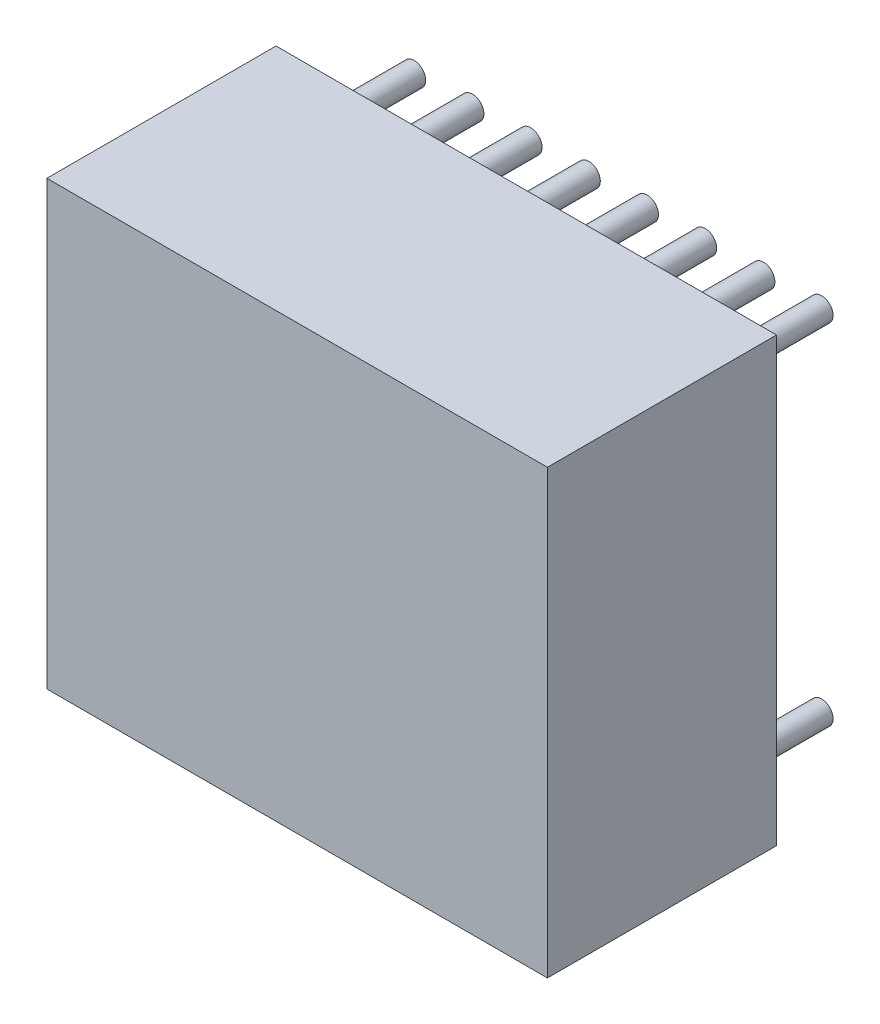
ISO-10303-21;
HEADER;
FILE_DESCRIPTION(('STEP AP214'),'2;1');
FILE_NAME('part.step','',(''),(''),'','','');
FILE_SCHEMA(('AUTOMOTIVE_DESIGN { 1 0 10303 214 1 1 1 1 }'));
ENDSEC;
DATA;
#1=APPLICATION_CONTEXT('core data for automotive mechanical design processes');
#2=APPLICATION_PROTOCOL_DEFINITION('international standard','automotive_design',2000,#1);
#3=PRODUCT_CONTEXT('',#1,'mechanical');
#4=PRODUCT('Part','Part','',(#3));
#5=PRODUCT_RELATED_PRODUCT_CATEGORY('part','',(#4));
#6=PRODUCT_DEFINITION_FORMATION('','',#4);
#7=PRODUCT_DEFINITION_CONTEXT('part definition',#1,'design');
#8=PRODUCT_DEFINITION('design','',#6,#7);
#9=PRODUCT_DEFINITION_SHAPE('','',#8);
#10=(LENGTH_UNIT() NAMED_UNIT(*) SI_UNIT(.MILLI.,.METRE.));
#11=(NAMED_UNIT(*) PLANE_ANGLE_UNIT() SI_UNIT($,.RADIAN.));
#12=(NAMED_UNIT(*) SI_UNIT($,.STERADIAN.) SOLID_ANGLE_UNIT());
#13=UNCERTAINTY_MEASURE_WITH_UNIT(LENGTH_MEASURE(1.E-05),#10,'distance_accuracy_value','');
#14=(GEOMETRIC_REPRESENTATION_CONTEXT(3) GLOBAL_UNCERTAINTY_ASSIGNED_CONTEXT((#13)) GLOBAL_UNIT_ASSIGNED_CONTEXT((#10,
#11,#12)) REPRESENTATION_CONTEXT('',''));
#15=CARTESIAN_POINT('',(0.,0.,0.));
#16=DIRECTION('',(0.,0.,1.));
#17=DIRECTION('',(1.,0.,0.));
#18=AXIS2_PLACEMENT_3D('',#15,#16,#17);
#19=CARTESIAN_POINT('',(0.,7.62,-2.));
#20=DIRECTION('',(0.,0.,1.));
#21=DIRECTION('',(1.,0.,0.));
#22=AXIS2_PLACEMENT_3D('',#19,#20,#21);
#23=CYLINDRICAL_SURFACE('',#22,0.25);
#24=CARTESIAN_POINT('',(0.,7.62,-2.));
#25=DIRECTION('',(0.,0.,1.));
#26=DIRECTION('',(1.,0.,0.));
#27=AXIS2_PLACEMENT_3D('',#24,#25,#26);
#28=CIRCLE('',#27,0.25);
#29=CARTESIAN_POINT('',(0.25,7.62,-2.));
#30=VERTEX_POINT('',#29);
#31=EDGE_CURVE('E11',#30,#30,#28,.T.);
#32=ORIENTED_EDGE('',*,*,#31,.T.);
#33=EDGE_LOOP('',(#32));
#34=FACE_BOUND('',#33,.T.);
#35=CARTESIAN_POINT('',(0.,7.62,0.));
#36=DIRECTION('',(0.,0.,1.));
#37=DIRECTION('',(1.,0.,0.));
#38=AXIS2_PLACEMENT_3D('',#35,#36,#37);
#39=CIRCLE('',#38,0.25);
#40=CARTESIAN_POINT('',(0.25,7.62,0.));
#41=VERTEX_POINT('',#40);
#42=EDGE_CURVE('E43',#41,#41,#39,.T.);
#43=ORIENTED_EDGE('',*,*,#42,.F.);
#44=EDGE_LOOP('',(#43));
#45=FACE_BOUND('',#44,.T.);
#46=ADVANCED_FACE('F40',(#34,#45),#23,.T.);
#47=CARTESIAN_POINT('',(0.,7.62,-2.));
#48=DIRECTION('',(0.,0.,1.));
#49=DIRECTION('',(1.,0.,0.));
#50=AXIS2_PLACEMENT_3D('',#47,#48,#49);
#51=PLANE('',#50);
#52=ORIENTED_EDGE('',*,*,#31,.F.);
#53=EDGE_LOOP('',(#52));
#54=FACE_BOUND('',#53,.T.);
#55=ADVANCED_FACE('F55',(#54),#51,.F.);
#56=CARTESIAN_POINT('',(0.,7.62,0.));
#57=DIRECTION('',(0.,0.,1.));
#58=DIRECTION('',(1.,0.,0.));
#59=AXIS2_PLACEMENT_3D('',#56,#57,#58);
#60=PLANE('',#59);
#61=ORIENTED_EDGE('',*,*,#42,.T.);
#62=EDGE_LOOP('',(#61));
#63=FACE_BOUND('',#62,.T.);
#64=ADVANCED_FACE('F52',(#63),#60,.T.);
#65=CLOSED_SHELL('',(#46,#55,#64));
#66=MANIFOLD_SOLID_BREP('B2',#65);
#67=CARTESIAN_POINT('',(1.27,7.62,-2.));
#68=DIRECTION('',(0.,0.,1.));
#69=DIRECTION('',(1.,0.,0.));
#70=AXIS2_PLACEMENT_3D('',#67,#68,#69);
#71=CYLINDRICAL_SURFACE('',#70,0.25);
#72=CARTESIAN_POINT('',(1.27,7.62,-2.));
#73=DIRECTION('',(0.,0.,1.));
#74=DIRECTION('',(1.,0.,0.));
#75=AXIS2_PLACEMENT_3D('',#72,#73,#74);
#76=CIRCLE('',#75,0.25);
#77=CARTESIAN_POINT('',(1.52,7.62,-2.));
#78=VERTEX_POINT('',#77);
#79=EDGE_CURVE('E39',#78,#78,#76,.T.);
#80=ORIENTED_EDGE('',*,*,#79,.T.);
#81=EDGE_LOOP('',(#80));
#82=FACE_BOUND('',#81,.T.);
#83=CARTESIAN_POINT('',(1.27,7.62,0.));
#84=DIRECTION('',(0.,0.,1.));
#85=DIRECTION('',(1.,0.,0.));
#86=AXIS2_PLACEMENT_3D('',#83,#84,#85);
#87=CIRCLE('',#86,0.25);
#88=CARTESIAN_POINT('',(1.52,7.62,0.));
#89=VERTEX_POINT('',#88);
#90=EDGE_CURVE('E92',#89,#89,#87,.T.);
#91=ORIENTED_EDGE('',*,*,#90,.F.);
#92=EDGE_LOOP('',(#91));
#93=FACE_BOUND('',#92,.T.);
#94=ADVANCED_FACE('F89',(#82,#93),#71,.T.);
#95=CARTESIAN_POINT('',(1.27,7.62,-2.));
#96=DIRECTION('',(0.,0.,1.));
#97=DIRECTION('',(1.,0.,0.));
#98=AXIS2_PLACEMENT_3D('',#95,#96,#97);
#99=PLANE('',#98);
#100=ORIENTED_EDGE('',*,*,#79,.F.);
#101=EDGE_LOOP('',(#100));
#102=FACE_BOUND('',#101,.T.);
#103=ADVANCED_FACE('F104',(#102),#99,.F.);
#104=CARTESIAN_POINT('',(1.27,7.62,0.));
#105=DIRECTION('',(0.,0.,1.));
#106=DIRECTION('',(1.,0.,0.));
#107=AXIS2_PLACEMENT_3D('',#104,#105,#106);
#108=PLANE('',#107);
#109=ORIENTED_EDGE('',*,*,#90,.T.);
#110=EDGE_LOOP('',(#109));
#111=FACE_BOUND('',#110,.T.);
#112=ADVANCED_FACE('F101',(#111),#108,.T.);
#113=CLOSED_SHELL('',(#94,#103,#112));
#114=MANIFOLD_SOLID_BREP('B6',#113);
#115=CARTESIAN_POINT('',(2.54,7.62,-2.));
#116=DIRECTION('',(0.,0.,1.));
#117=DIRECTION('',(1.,0.,0.));
#118=AXIS2_PLACEMENT_3D('',#115,#116,#117);
#119=CYLINDRICAL_SURFACE('',#118,0.25);
#120=CARTESIAN_POINT('',(2.54,7.62,-2.));
#121=DIRECTION('',(0.,0.,1.));
#122=DIRECTION('',(1.,0.,0.));
#123=AXIS2_PLACEMENT_3D('',#120,#121,#122);
#124=CIRCLE('',#123,0.25);
#125=CARTESIAN_POINT('',(2.79,7.62,-2.));
#126=VERTEX_POINT('',#125);
#127=EDGE_CURVE('E88',#126,#126,#124,.T.);
#128=ORIENTED_EDGE('',*,*,#127,.T.);
#129=EDGE_LOOP('',(#128));
#130=FACE_BOUND('',#129,.T.);
#131=CARTESIAN_POINT('',(2.54,7.62,0.));
#132=DIRECTION('',(0.,0.,1.));
#133=DIRECTION('',(1.,0.,0.));
#134=AXIS2_PLACEMENT_3D('',#131,#132,#133);
#135=CIRCLE('',#134,0.25);
#136=CARTESIAN_POINT('',(2.79,7.62,0.));
#137=VERTEX_POINT('',#136);
#138=EDGE_CURVE('E141',#137,#137,#135,.T.);
#139=ORIENTED_EDGE('',*,*,#138,.F.);
#140=EDGE_LOOP('',(#139));
#141=FACE_BOUND('',#140,.T.);
#142=ADVANCED_FACE('F138',(#130,#141),#119,.T.);
#143=CARTESIAN_POINT('',(2.54,7.62,-2.));
#144=DIRECTION('',(0.,0.,1.));
#145=DIRECTION('',(1.,0.,0.));
#146=AXIS2_PLACEMENT_3D('',#143,#144,#145);
#147=PLANE('',#146);
#148=ORIENTED_EDGE('',*,*,#127,.F.);
#149=EDGE_LOOP('',(#148));
#150=FACE_BOUND('',#149,.T.);
#151=ADVANCED_FACE('F153',(#150),#147,.F.);
#152=CARTESIAN_POINT('',(2.54,7.62,0.));
#153=DIRECTION('',(0.,0.,1.));
#154=DIRECTION('',(1.,0.,0.));
#155=AXIS2_PLACEMENT_3D('',#152,#153,#154);
#156=PLANE('',#155);
#157=ORIENTED_EDGE('',*,*,#138,.T.);
#158=EDGE_LOOP('',(#157));
#159=FACE_BOUND('',#158,.T.);
#160=ADVANCED_FACE('F150',(#159),#156,.T.);
#161=CLOSED_SHELL('',(#142,#151,#160));
#162=MANIFOLD_SOLID_BREP('B34',#161);
#163=CARTESIAN_POINT('',(3.81,7.62,-2.));
#164=DIRECTION('',(0.,0.,1.));
#165=DIRECTION('',(1.,0.,0.));
#166=AXIS2_PLACEMENT_3D('',#163,#164,#165);
#167=CYLINDRICAL_SURFACE('',#166,0.25);
#168=CARTESIAN_POINT('',(3.81,7.62,-2.));
#169=DIRECTION('',(0.,0.,1.));
#170=DIRECTION('',(1.,0.,0.));
#171=AXIS2_PLACEMENT_3D('',#168,#169,#170);
#172=CIRCLE('',#171,0.25);
#173=CARTESIAN_POINT('',(4.06,7.62,-2.));
#174=VERTEX_POINT('',#173);
#175=EDGE_CURVE('E137',#174,#174,#172,.T.);
#176=ORIENTED_EDGE('',*,*,#175,.T.);
#177=EDGE_LOOP('',(#176));
#178=FACE_BOUND('',#177,.T.);
#179=CARTESIAN_POINT('',(3.81,7.62,0.));
#180=DIRECTION('',(0.,0.,1.));
#181=DIRECTION('',(1.,0.,0.));
#182=AXIS2_PLACEMENT_3D('',#179,#180,#181);
#183=CIRCLE('',#182,0.25);
#184=CARTESIAN_POINT('',(4.06,7.62,0.));
#185=VERTEX_POINT('',#184);
#186=EDGE_CURVE('E190',#185,#185,#183,.T.);
#187=ORIENTED_EDGE('',*,*,#186,.F.);
#188=EDGE_LOOP('',(#187));
#189=FACE_BOUND('',#188,.T.);
#190=ADVANCED_FACE('F187',(#178,#189),#167,.T.);
#191=CARTESIAN_POINT('',(3.81,7.62,-2.));
#192=DIRECTION('',(0.,0.,1.));
#193=DIRECTION('',(1.,0.,0.));
#194=AXIS2_PLACEMENT_3D('',#191,#192,#193);
#195=PLANE('',#194);
#196=ORIENTED_EDGE('',*,*,#175,.F.);
#197=EDGE_LOOP('',(#196));
#198=FACE_BOUND('',#197,.T.);
#199=ADVANCED_FACE('F202',(#198),#195,.F.);
#200=CARTESIAN_POINT('',(3.81,7.62,0.));
#201=DIRECTION('',(0.,0.,1.));
#202=DIRECTION('',(1.,0.,0.));
#203=AXIS2_PLACEMENT_3D('',#200,#201,#202);
#204=PLANE('',#203);
#205=ORIENTED_EDGE('',*,*,#186,.T.);
#206=EDGE_LOOP('',(#205));
#207=FACE_BOUND('',#206,.T.);
#208=ADVANCED_FACE('F199',(#207),#204,.T.);
#209=CLOSED_SHELL('',(#190,#199,#208));
#210=MANIFOLD_SOLID_BREP('B83',#209);
#211=CARTESIAN_POINT('',(5.08,7.62,-2.));
#212=DIRECTION('',(0.,0.,1.));
#213=DIRECTION('',(1.,0.,0.));
#214=AXIS2_PLACEMENT_3D('',#211,#212,#213);
#215=CYLINDRICAL_SURFACE('',#214,0.25);
#216=CARTESIAN_POINT('',(5.08,7.62,-2.));
#217=DIRECTION('',(0.,0.,1.));
#218=DIRECTION('',(1.,0.,0.));
#219=AXIS2_PLACEMENT_3D('',#216,#217,#218);
#220=CIRCLE('',#219,0.25);
#221=CARTESIAN_POINT('',(5.33,7.62,-2.));
#222=VERTEX_POINT('',#221);
#223=EDGE_CURVE('E186',#222,#222,#220,.T.);
#224=ORIENTED_EDGE('',*,*,#223,.T.);
#225=EDGE_LOOP('',(#224));
#226=FACE_BOUND('',#225,.T.);
#227=CARTESIAN_POINT('',(5.08,7.62,0.));
#228=DIRECTION('',(0.,0.,1.));
#229=DIRECTION('',(1.,0.,0.));
#230=AXIS2_PLACEMENT_3D('',#227,#228,#229);
#231=CIRCLE('',#230,0.25);
#232=CARTESIAN_POINT('',(5.33,7.62,0.));
#233=VERTEX_POINT('',#232);
#234=EDGE_CURVE('E239',#233,#233,#231,.T.);
#235=ORIENTED_EDGE('',*,*,#234,.F.);
#236=EDGE_LOOP('',(#235));
#237=FACE_BOUND('',#236,.T.);
#238=ADVANCED_FACE('F236',(#226,#237),#215,.T.);
#239=CARTESIAN_POINT('',(5.08,7.62,-2.));
#240=DIRECTION('',(0.,0.,1.));
#241=DIRECTION('',(1.,0.,0.));
#242=AXIS2_PLACEMENT_3D('',#239,#240,#241);
#243=PLANE('',#242);
#244=ORIENTED_EDGE('',*,*,#223,.F.);
#245=EDGE_LOOP('',(#244));
#246=FACE_BOUND('',#245,.T.);
#247=ADVANCED_FACE('F251',(#246),#243,.F.);
#248=CARTESIAN_POINT('',(5.08,7.62,0.));
#249=DIRECTION('',(0.,0.,1.));
#250=DIRECTION('',(1.,0.,0.));
#251=AXIS2_PLACEMENT_3D('',#248,#249,#250);
#252=PLANE('',#251);
#253=ORIENTED_EDGE('',*,*,#234,.T.);
#254=EDGE_LOOP('',(#253));
#255=FACE_BOUND('',#254,.T.);
#256=ADVANCED_FACE('F248',(#255),#252,.T.);
#257=CLOSED_SHELL('',(#238,#247,#256));
#258=MANIFOLD_SOLID_BREP('B132',#257);
#259=CARTESIAN_POINT('',(6.35,7.62,-2.));
#260=DIRECTION('',(0.,0.,1.));
#261=DIRECTION('',(1.,0.,0.));
#262=AXIS2_PLACEMENT_3D('',#259,#260,#261);
#263=CYLINDRICAL_SURFACE('',#262,0.25);
#264=CARTESIAN_POINT('',(6.35,7.62,-2.));
#265=DIRECTION('',(0.,0.,1.));
#266=DIRECTION('',(1.,0.,0.));
#267=AXIS2_PLACEMENT_3D('',#264,#265,#266);
#268=CIRCLE('',#267,0.25);
#269=CARTESIAN_POINT('',(6.6,7.62,-2.));
#270=VERTEX_POINT('',#269);
#271=EDGE_CURVE('E235',#270,#270,#268,.T.);
#272=ORIENTED_EDGE('',*,*,#271,.T.);
#273=EDGE_LOOP('',(#272));
#274=FACE_BOUND('',#273,.T.);
#275=CARTESIAN_POINT('',(6.35,7.62,0.));
#276=DIRECTION('',(0.,0.,1.));
#277=DIRECTION('',(1.,0.,0.));
#278=AXIS2_PLACEMENT_3D('',#275,#276,#277);
#279=CIRCLE('',#278,0.25);
#280=CARTESIAN_POINT('',(6.6,7.62,0.));
#281=VERTEX_POINT('',#280);
#282=EDGE_CURVE('E288',#281,#281,#279,.T.);
#283=ORIENTED_EDGE('',*,*,#282,.F.);
#284=EDGE_LOOP('',(#283));
#285=FACE_BOUND('',#284,.T.);
#286=ADVANCED_FACE('F285',(#274,#285),#263,.T.);
#287=CARTESIAN_POINT('',(6.35,7.62,-2.));
#288=DIRECTION('',(0.,0.,1.));
#289=DIRECTION('',(1.,0.,0.));
#290=AXIS2_PLACEMENT_3D('',#287,#288,#289);
#291=PLANE('',#290);
#292=ORIENTED_EDGE('',*,*,#271,.F.);
#293=EDGE_LOOP('',(#292));
#294=FACE_BOUND('',#293,.T.);
#295=ADVANCED_FACE('F300',(#294),#291,.F.);
#296=CARTESIAN_POINT('',(6.35,7.62,0.));
#297=DIRECTION('',(0.,0.,1.));
#298=DIRECTION('',(1.,0.,0.));
#299=AXIS2_PLACEMENT_3D('',#296,#297,#298);
#300=PLANE('',#299);
#301=ORIENTED_EDGE('',*,*,#282,.T.);
#302=EDGE_LOOP('',(#301));
#303=FACE_BOUND('',#302,.T.);
#304=ADVANCED_FACE('F297',(#303),#300,.T.);
#305=CLOSED_SHELL('',(#286,#295,#304));
#306=MANIFOLD_SOLID_BREP('B181',#305);
#307=CARTESIAN_POINT('',(7.62,7.62,-2.));
#308=DIRECTION('',(0.,0.,1.));
#309=DIRECTION('',(1.,0.,0.));
#310=AXIS2_PLACEMENT_3D('',#307,#308,#309);
#311=CYLINDRICAL_SURFACE('',#310,0.25);
#312=CARTESIAN_POINT('',(7.62,7.62,-2.));
#313=DIRECTION('',(0.,0.,1.));
#314=DIRECTION('',(1.,0.,0.));
#315=AXIS2_PLACEMENT_3D('',#312,#313,#314);
#316=CIRCLE('',#315,0.25);
#317=CARTESIAN_POINT('',(7.87,7.62,-2.));
#318=VERTEX_POINT('',#317);
#319=EDGE_CURVE('E284',#318,#318,#316,.T.);
#320=ORIENTED_EDGE('',*,*,#319,.T.);
#321=EDGE_LOOP('',(#320));
#322=FACE_BOUND('',#321,.T.);
#323=CARTESIAN_POINT('',(7.62,7.62,0.));
#324=DIRECTION('',(0.,0.,1.));
#325=DIRECTION('',(1.,0.,0.));
#326=AXIS2_PLACEMENT_3D('',#323,#324,#325);
#327=CIRCLE('',#326,0.25);
#328=CARTESIAN_POINT('',(7.87,7.62,0.));
#329=VERTEX_POINT('',#328);
#330=EDGE_CURVE('E337',#329,#329,#327,.T.);
#331=ORIENTED_EDGE('',*,*,#330,.F.);
#332=EDGE_LOOP('',(#331));
#333=FACE_BOUND('',#332,.T.);
#334=ADVANCED_FACE('F334',(#322,#333),#311,.T.);
#335=CARTESIAN_POINT('',(7.62,7.62,-2.));
#336=DIRECTION('',(0.,0.,1.));
#337=DIRECTION('',(1.,0.,0.));
#338=AXIS2_PLACEMENT_3D('',#335,#336,#337);
#339=PLANE('',#338);
#340=ORIENTED_EDGE('',*,*,#319,.F.);
#341=EDGE_LOOP('',(#340));
#342=FACE_BOUND('',#341,.T.);
#343=ADVANCED_FACE('F349',(#342),#339,.F.);
#344=CARTESIAN_POINT('',(7.62,7.62,0.));
#345=DIRECTION('',(0.,0.,1.));
#346=DIRECTION('',(1.,0.,0.));
#347=AXIS2_PLACEMENT_3D('',#344,#345,#346);
#348=PLANE('',#347);
#349=ORIENTED_EDGE('',*,*,#330,.T.);
#350=EDGE_LOOP('',(#349));
#351=FACE_BOUND('',#350,.T.);
#352=ADVANCED_FACE('F346',(#351),#348,.T.);
#353=CLOSED_SHELL('',(#334,#343,#352));
#354=MANIFOLD_SOLID_BREP('B230',#353);
#355=CARTESIAN_POINT('',(8.89,7.62,-2.));
#356=DIRECTION('',(0.,0.,1.));
#357=DIRECTION('',(1.,0.,0.));
#358=AXIS2_PLACEMENT_3D('',#355,#356,#357);
#359=CYLINDRICAL_SURFACE('',#358,0.25);
#360=CARTESIAN_POINT('',(8.89,7.62,-2.));
#361=DIRECTION('',(0.,0.,1.));
#362=DIRECTION('',(1.,0.,0.));
#363=AXIS2_PLACEMENT_3D('',#360,#361,#362);
#364=CIRCLE('',#363,0.25);
#365=CARTESIAN_POINT('',(9.14,7.62,-2.));
#366=VERTEX_POINT('',#365);
#367=EDGE_CURVE('E333',#366,#366,#364,.T.);
#368=ORIENTED_EDGE('',*,*,#367,.T.);
#369=EDGE_LOOP('',(#368));
#370=FACE_BOUND('',#369,.T.);
#371=CARTESIAN_POINT('',(8.89,7.62,0.));
#372=DIRECTION('',(0.,0.,1.));
#373=DIRECTION('',(1.,0.,0.));
#374=AXIS2_PLACEMENT_3D('',#371,#372,#373);
#375=CIRCLE('',#374,0.25);
#376=CARTESIAN_POINT('',(9.14,7.62,0.));
#377=VERTEX_POINT('',#376);
#378=EDGE_CURVE('E386',#377,#377,#375,.T.);
#379=ORIENTED_EDGE('',*,*,#378,.F.);
#380=EDGE_LOOP('',(#379));
#381=FACE_BOUND('',#380,.T.);
#382=ADVANCED_FACE('F383',(#370,#381),#359,.T.);
#383=CARTESIAN_POINT('',(8.89,7.62,-2.));
#384=DIRECTION('',(0.,0.,1.));
#385=DIRECTION('',(1.,0.,0.));
#386=AXIS2_PLACEMENT_3D('',#383,#384,#385);
#387=PLANE('',#386);
#388=ORIENTED_EDGE('',*,*,#367,.F.);
#389=EDGE_LOOP('',(#388));
#390=FACE_BOUND('',#389,.T.);
#391=ADVANCED_FACE('F398',(#390),#387,.F.);
#392=CARTESIAN_POINT('',(8.89,7.62,0.));
#393=DIRECTION('',(0.,0.,1.));
#394=DIRECTION('',(1.,0.,0.));
#395=AXIS2_PLACEMENT_3D('',#392,#393,#394);
#396=PLANE('',#395);
#397=ORIENTED_EDGE('',*,*,#378,.T.);
#398=EDGE_LOOP('',(#397));
#399=FACE_BOUND('',#398,.T.);
#400=ADVANCED_FACE('F395',(#399),#396,.T.);
#401=CLOSED_SHELL('',(#382,#391,#400));
#402=MANIFOLD_SOLID_BREP('B279',#401);
#403=CARTESIAN_POINT('',(8.89,0.,-2.));
#404=DIRECTION('',(0.,0.,1.));
#405=DIRECTION('',(1.,0.,0.));
#406=AXIS2_PLACEMENT_3D('',#403,#404,#405);
#407=CYLINDRICAL_SURFACE('',#406,0.25);
#408=CARTESIAN_POINT('',(8.89,0.,-2.));
#409=DIRECTION('',(0.,0.,1.));
#410=DIRECTION('',(1.,0.,0.));
#411=AXIS2_PLACEMENT_3D('',#408,#409,#410);
#412=CIRCLE('',#411,0.25);
#413=CARTESIAN_POINT('',(9.14,0.,-2.));
#414=VERTEX_POINT('',#413);
#415=EDGE_CURVE('E382',#414,#414,#412,.T.);
#416=ORIENTED_EDGE('',*,*,#415,.T.);
#417=EDGE_LOOP('',(#416));
#418=FACE_BOUND('',#417,.T.);
#419=CARTESIAN_POINT('',(8.89,0.,0.));
#420=DIRECTION('',(0.,0.,1.));
#421=DIRECTION('',(1.,0.,0.));
#422=AXIS2_PLACEMENT_3D('',#419,#420,#421);
#423=CIRCLE('',#422,0.25);
#424=CARTESIAN_POINT('',(9.14,0.,0.));
#425=VERTEX_POINT('',#424);
#426=EDGE_CURVE('E435',#425,#425,#423,.T.);
#427=ORIENTED_EDGE('',*,*,#426,.F.);
#428=EDGE_LOOP('',(#427));
#429=FACE_BOUND('',#428,.T.);
#430=ADVANCED_FACE('F432',(#418,#429),#407,.T.);
#431=CARTESIAN_POINT('',(8.89,0.,-2.));
#432=DIRECTION('',(0.,0.,1.));
#433=DIRECTION('',(1.,0.,0.));
#434=AXIS2_PLACEMENT_3D('',#431,#432,#433);
#435=PLANE('',#434);
#436=ORIENTED_EDGE('',*,*,#415,.F.);
#437=EDGE_LOOP('',(#436));
#438=FACE_BOUND('',#437,.T.);
#439=ADVANCED_FACE('F447',(#438),#435,.F.);
#440=CARTESIAN_POINT('',(8.89,0.,0.));
#441=DIRECTION('',(0.,0.,1.));
#442=DIRECTION('',(1.,0.,0.));
#443=AXIS2_PLACEMENT_3D('',#440,#441,#442);
#444=PLANE('',#443);
#445=ORIENTED_EDGE('',*,*,#426,.T.);
#446=EDGE_LOOP('',(#445));
#447=FACE_BOUND('',#446,.T.);
#448=ADVANCED_FACE('F444',(#447),#444,.T.);
#449=CLOSED_SHELL('',(#430,#439,#448));
#450=MANIFOLD_SOLID_BREP('B328',#449);
#451=CARTESIAN_POINT('',(7.62,0.,-2.));
#452=DIRECTION('',(0.,0.,1.));
#453=DIRECTION('',(1.,0.,0.));
#454=AXIS2_PLACEMENT_3D('',#451,#452,#453);
#455=CYLINDRICAL_SURFACE('',#454,0.25);
#456=CARTESIAN_POINT('',(7.62,0.,-2.));
#457=DIRECTION('',(0.,0.,1.));
#458=DIRECTION('',(1.,0.,0.));
#459=AXIS2_PLACEMENT_3D('',#456,#457,#458);
#460=CIRCLE('',#459,0.25);
#461=CARTESIAN_POINT('',(7.87,0.,-2.));
#462=VERTEX_POINT('',#461);
#463=EDGE_CURVE('E431',#462,#462,#460,.T.);
#464=ORIENTED_EDGE('',*,*,#463,.T.);
#465=EDGE_LOOP('',(#464));
#466=FACE_BOUND('',#465,.T.);
#467=CARTESIAN_POINT('',(7.62,0.,0.));
#468=DIRECTION('',(0.,0.,1.));
#469=DIRECTION('',(1.,0.,0.));
#470=AXIS2_PLACEMENT_3D('',#467,#468,#469);
#471=CIRCLE('',#470,0.25);
#472=CARTESIAN_POINT('',(7.87,0.,0.));
#473=VERTEX_POINT('',#472);
#474=EDGE_CURVE('E484',#473,#473,#471,.T.);
#475=ORIENTED_EDGE('',*,*,#474,.F.);
#476=EDGE_LOOP('',(#475));
#477=FACE_BOUND('',#476,.T.);
#478=ADVANCED_FACE('F481',(#466,#477),#455,.T.);
#479=CARTESIAN_POINT('',(7.62,0.,-2.));
#480=DIRECTION('',(0.,0.,1.));
#481=DIRECTION('',(1.,0.,0.));
#482=AXIS2_PLACEMENT_3D('',#479,#480,#481);
#483=PLANE('',#482);
#484=ORIENTED_EDGE('',*,*,#463,.F.);
#485=EDGE_LOOP('',(#484));
#486=FACE_BOUND('',#485,.T.);
#487=ADVANCED_FACE('F496',(#486),#483,.F.);
#488=CARTESIAN_POINT('',(7.62,0.,0.));
#489=DIRECTION('',(0.,0.,1.));
#490=DIRECTION('',(1.,0.,0.));
#491=AXIS2_PLACEMENT_3D('',#488,#489,#490);
#492=PLANE('',#491);
#493=ORIENTED_EDGE('',*,*,#474,.T.);
#494=EDGE_LOOP('',(#493));
#495=FACE_BOUND('',#494,.T.);
#496=ADVANCED_FACE('F493',(#495),#492,.T.);
#497=CLOSED_SHELL('',(#478,#487,#496));
#498=MANIFOLD_SOLID_BREP('B377',#497);
#499=CARTESIAN_POINT('',(6.35,0.,-2.));
#500=DIRECTION('',(0.,0.,1.));
#501=DIRECTION('',(1.,0.,0.));
#502=AXIS2_PLACEMENT_3D('',#499,#500,#501);
#503=CYLINDRICAL_SURFACE('',#502,0.25);
#504=CARTESIAN_POINT('',(6.35,0.,-2.));
#505=DIRECTION('',(0.,0.,1.));
#506=DIRECTION('',(1.,0.,0.));
#507=AXIS2_PLACEMENT_3D('',#504,#505,#506);
#508=CIRCLE('',#507,0.25);
#509=CARTESIAN_POINT('',(6.6,0.,-2.));
#510=VERTEX_POINT('',#509);
#511=EDGE_CURVE('E480',#510,#510,#508,.T.);
#512=ORIENTED_EDGE('',*,*,#511,.T.);
#513=EDGE_LOOP('',(#512));
#514=FACE_BOUND('',#513,.T.);
#515=CARTESIAN_POINT('',(6.35,0.,0.));
#516=DIRECTION('',(0.,0.,1.));
#517=DIRECTION('',(1.,0.,0.));
#518=AXIS2_PLACEMENT_3D('',#515,#516,#517);
#519=CIRCLE('',#518,0.25);
#520=CARTESIAN_POINT('',(6.6,0.,0.));
#521=VERTEX_POINT('',#520);
#522=EDGE_CURVE('E533',#521,#521,#519,.T.);
#523=ORIENTED_EDGE('',*,*,#522,.F.);
#524=EDGE_LOOP('',(#523));
#525=FACE_BOUND('',#524,.T.);
#526=ADVANCED_FACE('F530',(#514,#525),#503,.T.);
#527=CARTESIAN_POINT('',(6.35,0.,-2.));
#528=DIRECTION('',(0.,0.,1.));
#529=DIRECTION('',(1.,0.,0.));
#530=AXIS2_PLACEMENT_3D('',#527,#528,#529);
#531=PLANE('',#530);
#532=ORIENTED_EDGE('',*,*,#511,.F.);
#533=EDGE_LOOP('',(#532));
#534=FACE_BOUND('',#533,.T.);
#535=ADVANCED_FACE('F545',(#534),#531,.F.);
#536=CARTESIAN_POINT('',(6.35,0.,0.));
#537=DIRECTION('',(0.,0.,1.));
#538=DIRECTION('',(1.,0.,0.));
#539=AXIS2_PLACEMENT_3D('',#536,#537,#538);
#540=PLANE('',#539);
#541=ORIENTED_EDGE('',*,*,#522,.T.);
#542=EDGE_LOOP('',(#541));
#543=FACE_BOUND('',#542,.T.);
#544=ADVANCED_FACE('F542',(#543),#540,.T.);
#545=CLOSED_SHELL('',(#526,#535,#544));
#546=MANIFOLD_SOLID_BREP('B426',#545);
#547=CARTESIAN_POINT('',(5.08,0.,-2.));
#548=DIRECTION('',(0.,0.,1.));
#549=DIRECTION('',(1.,0.,0.));
#550=AXIS2_PLACEMENT_3D('',#547,#548,#549);
#551=CYLINDRICAL_SURFACE('',#550,0.25);
#552=CARTESIAN_POINT('',(5.08,0.,-2.));
#553=DIRECTION('',(0.,0.,1.));
#554=DIRECTION('',(1.,0.,0.));
#555=AXIS2_PLACEMENT_3D('',#552,#553,#554);
#556=CIRCLE('',#555,0.25);
#557=CARTESIAN_POINT('',(5.33,0.,-2.));
#558=VERTEX_POINT('',#557);
#559=EDGE_CURVE('E529',#558,#558,#556,.T.);
#560=ORIENTED_EDGE('',*,*,#559,.T.);
#561=EDGE_LOOP('',(#560));
#562=FACE_BOUND('',#561,.T.);
#563=CARTESIAN_POINT('',(5.08,0.,0.));
#564=DIRECTION('',(0.,0.,1.));
#565=DIRECTION('',(1.,0.,0.));
#566=AXIS2_PLACEMENT_3D('',#563,#564,#565);
#567=CIRCLE('',#566,0.25);
#568=CARTESIAN_POINT('',(5.33,0.,0.));
#569=VERTEX_POINT('',#568);
#570=EDGE_CURVE('E582',#569,#569,#567,.T.);
#571=ORIENTED_EDGE('',*,*,#570,.F.);
#572=EDGE_LOOP('',(#571));
#573=FACE_BOUND('',#572,.T.);
#574=ADVANCED_FACE('F579',(#562,#573),#551,.T.);
#575=CARTESIAN_POINT('',(5.08,0.,-2.));
#576=DIRECTION('',(0.,0.,1.));
#577=DIRECTION('',(1.,0.,0.));
#578=AXIS2_PLACEMENT_3D('',#575,#576,#577);
#579=PLANE('',#578);
#580=ORIENTED_EDGE('',*,*,#559,.F.);
#581=EDGE_LOOP('',(#580));
#582=FACE_BOUND('',#581,.T.);
#583=ADVANCED_FACE('F594',(#582),#579,.F.);
#584=CARTESIAN_POINT('',(5.08,0.,0.));
#585=DIRECTION('',(0.,0.,1.));
#586=DIRECTION('',(1.,0.,0.));
#587=AXIS2_PLACEMENT_3D('',#584,#585,#586);
#588=PLANE('',#587);
#589=ORIENTED_EDGE('',*,*,#570,.T.);
#590=EDGE_LOOP('',(#589));
#591=FACE_BOUND('',#590,.T.);
#592=ADVANCED_FACE('F591',(#591),#588,.T.);
#593=CLOSED_SHELL('',(#574,#583,#592));
#594=MANIFOLD_SOLID_BREP('B475',#593);
#595=CARTESIAN_POINT('',(3.81,0.,-2.));
#596=DIRECTION('',(0.,0.,1.));
#597=DIRECTION('',(1.,0.,0.));
#598=AXIS2_PLACEMENT_3D('',#595,#596,#597);
#599=CYLINDRICAL_SURFACE('',#598,0.25);
#600=CARTESIAN_POINT('',(3.81,0.,-2.));
#601=DIRECTION('',(0.,0.,1.));
#602=DIRECTION('',(1.,0.,0.));
#603=AXIS2_PLACEMENT_3D('',#600,#601,#602);
#604=CIRCLE('',#603,0.25);
#605=CARTESIAN_POINT('',(4.06,0.,-2.));
#606=VERTEX_POINT('',#605);
#607=EDGE_CURVE('E578',#606,#606,#604,.T.);
#608=ORIENTED_EDGE('',*,*,#607,.T.);
#609=EDGE_LOOP('',(#608));
#610=FACE_BOUND('',#609,.T.);
#611=CARTESIAN_POINT('',(3.81,0.,0.));
#612=DIRECTION('',(0.,0.,1.));
#613=DIRECTION('',(1.,0.,0.));
#614=AXIS2_PLACEMENT_3D('',#611,#612,#613);
#615=CIRCLE('',#614,0.25);
#616=CARTESIAN_POINT('',(4.06,0.,0.));
#617=VERTEX_POINT('',#616);
#618=EDGE_CURVE('E631',#617,#617,#615,.T.);
#619=ORIENTED_EDGE('',*,*,#618,.F.);
#620=EDGE_LOOP('',(#619));
#621=FACE_BOUND('',#620,.T.);
#622=ADVANCED_FACE('F628',(#610,#621),#599,.T.);
#623=CARTESIAN_POINT('',(3.81,0.,-2.));
#624=DIRECTION('',(0.,0.,1.));
#625=DIRECTION('',(1.,0.,0.));
#626=AXIS2_PLACEMENT_3D('',#623,#624,#625);
#627=PLANE('',#626);
#628=ORIENTED_EDGE('',*,*,#607,.F.);
#629=EDGE_LOOP('',(#628));
#630=FACE_BOUND('',#629,.T.);
#631=ADVANCED_FACE('F643',(#630),#627,.F.);
#632=CARTESIAN_POINT('',(3.81,0.,0.));
#633=DIRECTION('',(0.,0.,1.));
#634=DIRECTION('',(1.,0.,0.));
#635=AXIS2_PLACEMENT_3D('',#632,#633,#634);
#636=PLANE('',#635);
#637=ORIENTED_EDGE('',*,*,#618,.T.);
#638=EDGE_LOOP('',(#637));
#639=FACE_BOUND('',#638,.T.);
#640=ADVANCED_FACE('F640',(#639),#636,.T.);
#641=CLOSED_SHELL('',(#622,#631,#640));
#642=MANIFOLD_SOLID_BREP('B524',#641);
#643=CARTESIAN_POINT('',(2.54,0.,-2.));
#644=DIRECTION('',(0.,0.,1.));
#645=DIRECTION('',(1.,0.,0.));
#646=AXIS2_PLACEMENT_3D('',#643,#644,#645);
#647=CYLINDRICAL_SURFACE('',#646,0.25);
#648=CARTESIAN_POINT('',(2.54,0.,-2.));
#649=DIRECTION('',(0.,0.,1.));
#650=DIRECTION('',(1.,0.,0.));
#651=AXIS2_PLACEMENT_3D('',#648,#649,#650);
#652=CIRCLE('',#651,0.25);
#653=CARTESIAN_POINT('',(2.79,0.,-2.));
#654=VERTEX_POINT('',#653);
#655=EDGE_CURVE('E627',#654,#654,#652,.T.);
#656=ORIENTED_EDGE('',*,*,#655,.T.);
#657=EDGE_LOOP('',(#656));
#658=FACE_BOUND('',#657,.T.);
#659=CARTESIAN_POINT('',(2.54,0.,0.));
#660=DIRECTION('',(0.,0.,1.));
#661=DIRECTION('',(1.,0.,0.));
#662=AXIS2_PLACEMENT_3D('',#659,#660,#661);
#663=CIRCLE('',#662,0.25);
#664=CARTESIAN_POINT('',(2.79,0.,0.));
#665=VERTEX_POINT('',#664);
#666=EDGE_CURVE('E680',#665,#665,#663,.T.);
#667=ORIENTED_EDGE('',*,*,#666,.F.);
#668=EDGE_LOOP('',(#667));
#669=FACE_BOUND('',#668,.T.);
#670=ADVANCED_FACE('F677',(#658,#669),#647,.T.);
#671=CARTESIAN_POINT('',(2.54,0.,-2.));
#672=DIRECTION('',(0.,0.,1.));
#673=DIRECTION('',(1.,0.,0.));
#674=AXIS2_PLACEMENT_3D('',#671,#672,#673);
#675=PLANE('',#674);
#676=ORIENTED_EDGE('',*,*,#655,.F.);
#677=EDGE_LOOP('',(#676));
#678=FACE_BOUND('',#677,.T.);
#679=ADVANCED_FACE('F692',(#678),#675,.F.);
#680=CARTESIAN_POINT('',(2.54,0.,0.));
#681=DIRECTION('',(0.,0.,1.));
#682=DIRECTION('',(1.,0.,0.));
#683=AXIS2_PLACEMENT_3D('',#680,#681,#682);
#684=PLANE('',#683);
#685=ORIENTED_EDGE('',*,*,#666,.T.);
#686=EDGE_LOOP('',(#685));
#687=FACE_BOUND('',#686,.T.);
#688=ADVANCED_FACE('F689',(#687),#684,.T.);
#689=CLOSED_SHELL('',(#670,#679,#688));
#690=MANIFOLD_SOLID_BREP('B573',#689);
#691=CARTESIAN_POINT('',(1.27,0.,-2.));
#692=DIRECTION('',(0.,0.,1.));
#693=DIRECTION('',(1.,0.,0.));
#694=AXIS2_PLACEMENT_3D('',#691,#692,#693);
#695=CYLINDRICAL_SURFACE('',#694,0.25);
#696=CARTESIAN_POINT('',(1.27,0.,-2.));
#697=DIRECTION('',(0.,0.,1.));
#698=DIRECTION('',(1.,0.,0.));
#699=AXIS2_PLACEMENT_3D('',#696,#697,#698);
#700=CIRCLE('',#699,0.25);
#701=CARTESIAN_POINT('',(1.52,0.,-2.));
#702=VERTEX_POINT('',#701);
#703=EDGE_CURVE('E676',#702,#702,#700,.T.);
#704=ORIENTED_EDGE('',*,*,#703,.T.);
#705=EDGE_LOOP('',(#704));
#706=FACE_BOUND('',#705,.T.);
#707=CARTESIAN_POINT('',(1.27,0.,0.));
#708=DIRECTION('',(0.,0.,1.));
#709=DIRECTION('',(1.,0.,0.));
#710=AXIS2_PLACEMENT_3D('',#707,#708,#709);
#711=CIRCLE('',#710,0.25);
#712=CARTESIAN_POINT('',(1.52,0.,0.));
#713=VERTEX_POINT('',#712);
#714=EDGE_CURVE('E729',#713,#713,#711,.T.);
#715=ORIENTED_EDGE('',*,*,#714,.F.);
#716=EDGE_LOOP('',(#715));
#717=FACE_BOUND('',#716,.T.);
#718=ADVANCED_FACE('F726',(#706,#717),#695,.T.);
#719=CARTESIAN_POINT('',(1.27,0.,-2.));
#720=DIRECTION('',(0.,0.,1.));
#721=DIRECTION('',(1.,0.,0.));
#722=AXIS2_PLACEMENT_3D('',#719,#720,#721);
#723=PLANE('',#722);
#724=ORIENTED_EDGE('',*,*,#703,.F.);
#725=EDGE_LOOP('',(#724));
#726=FACE_BOUND('',#725,.T.);
#727=ADVANCED_FACE('F741',(#726),#723,.F.);
#728=CARTESIAN_POINT('',(1.27,0.,0.));
#729=DIRECTION('',(0.,0.,1.));
#730=DIRECTION('',(1.,0.,0.));
#731=AXIS2_PLACEMENT_3D('',#728,#729,#730);
#732=PLANE('',#731);
#733=ORIENTED_EDGE('',*,*,#714,.T.);
#734=EDGE_LOOP('',(#733));
#735=FACE_BOUND('',#734,.T.);
#736=ADVANCED_FACE('F738',(#735),#732,.T.);
#737=CLOSED_SHELL('',(#718,#727,#736));
#738=MANIFOLD_SOLID_BREP('B622',#737);
#739=CARTESIAN_POINT('',(0.,0.,-2.));
#740=DIRECTION('',(0.,0.,1.));
#741=DIRECTION('',(1.,0.,0.));
#742=AXIS2_PLACEMENT_3D('',#739,#740,#741);
#743=CYLINDRICAL_SURFACE('',#742,0.25);
#744=CARTESIAN_POINT('',(0.,0.,-2.));
#745=DIRECTION('',(0.,0.,1.));
#746=DIRECTION('',(1.,0.,0.));
#747=AXIS2_PLACEMENT_3D('',#744,#745,#746);
#748=CIRCLE('',#747,0.25);
#749=CARTESIAN_POINT('',(0.25,0.,-2.));
#750=VERTEX_POINT('',#749);
#751=EDGE_CURVE('E725',#750,#750,#748,.T.);
#752=ORIENTED_EDGE('',*,*,#751,.T.);
#753=EDGE_LOOP('',(#752));
#754=FACE_BOUND('',#753,.T.);
#755=CARTESIAN_POINT('',(0.,0.,0.));
#756=DIRECTION('',(0.,0.,1.));
#757=DIRECTION('',(1.,0.,0.));
#758=AXIS2_PLACEMENT_3D('',#755,#756,#757);
#759=CIRCLE('',#758,0.25);
#760=CARTESIAN_POINT('',(0.25,0.,0.));
#761=VERTEX_POINT('',#760);
#762=EDGE_CURVE('E779',#761,#761,#759,.T.);
#763=ORIENTED_EDGE('',*,*,#762,.F.);
#764=EDGE_LOOP('',(#763));
#765=FACE_BOUND('',#764,.T.);
#766=ADVANCED_FACE('F776',(#754,#765),#743,.T.);
#767=CARTESIAN_POINT('',(0.,0.,-2.));
#768=DIRECTION('',(0.,0.,1.));
#769=DIRECTION('',(1.,0.,0.));
#770=AXIS2_PLACEMENT_3D('',#767,#768,#769);
#771=PLANE('',#770);
#772=ORIENTED_EDGE('',*,*,#751,.F.);
#773=EDGE_LOOP('',(#772));
#774=FACE_BOUND('',#773,.T.);
#775=ADVANCED_FACE('F791',(#774),#771,.F.);
#776=CARTESIAN_POINT('',(0.,0.,0.));
#777=DIRECTION('',(0.,0.,1.));
#778=DIRECTION('',(1.,0.,0.));
#779=AXIS2_PLACEMENT_3D('',#776,#777,#778);
#780=PLANE('',#779);
#781=ORIENTED_EDGE('',*,*,#762,.T.);
#782=EDGE_LOOP('',(#781));
#783=FACE_BOUND('',#782,.T.);
#784=ADVANCED_FACE('F788',(#783),#780,.T.);
#785=CLOSED_SHELL('',(#766,#775,#784));
#786=MANIFOLD_SOLID_BREP('B671',#785);
#787=CARTESIAN_POINT('',(9.906,8.636,5.));
#788=DIRECTION('',(0.,-1.,0.));
#789=DIRECTION('',(0.,0.,-1.));
#790=AXIS2_PLACEMENT_3D('',#787,#788,#789);
#791=PLANE('',#790);
#792=DIRECTION('',(-1.,0.,0.));
#793=VECTOR('',#792,1.);
#794=CARTESIAN_POINT('',(9.906,8.636,0.));
#795=LINE('',#794,#793);
#796=CARTESIAN_POINT('',(9.906,8.636,0.));
#797=VERTEX_POINT('',#796);
#798=CARTESIAN_POINT('',(-1.016,8.636,0.));
#799=VERTEX_POINT('',#798);
#800=EDGE_CURVE('E880',#797,#799,#795,.T.);
#801=ORIENTED_EDGE('',*,*,#800,.T.);
#802=DIRECTION('',(0.,0.,-1.));
#803=VECTOR('',#802,1.);
#804=CARTESIAN_POINT('',(-1.016,8.636,5.));
#805=LINE('',#804,#803);
#806=CARTESIAN_POINT('',(-1.016,8.636,5.));
#807=VERTEX_POINT('',#806);
#808=EDGE_CURVE('E774',#807,#799,#805,.T.);
#809=ORIENTED_EDGE('',*,*,#808,.F.);
#810=DIRECTION('',(-1.,0.,0.));
#811=VECTOR('',#810,1.);
#812=CARTESIAN_POINT('',(9.906,8.636,5.));
#813=LINE('',#812,#811);
#814=CARTESIAN_POINT('',(9.906,8.636,5.));
#815=VERTEX_POINT('',#814);
#816=EDGE_CURVE('E868',#815,#807,#813,.T.);
#817=ORIENTED_EDGE('',*,*,#816,.F.);
#818=DIRECTION('',(0.,0.,-1.));
#819=VECTOR('',#818,1.);
#820=CARTESIAN_POINT('',(9.906,8.636,5.));
#821=LINE('',#820,#819);
#822=EDGE_CURVE('E876',#815,#797,#821,.T.);
#823=ORIENTED_EDGE('',*,*,#822,.T.);
#824=EDGE_LOOP('',(#801,#809,#817,#823));
#825=FACE_BOUND('',#824,.T.);
#826=ADVANCED_FACE('F817',(#825),#791,.F.);
#827=CARTESIAN_POINT('',(-1.016,8.636,5.));
#828=DIRECTION('',(1.,0.,0.));
#829=DIRECTION('',(0.,0.,-1.));
#830=AXIS2_PLACEMENT_3D('',#827,#828,#829);
#831=PLANE('',#830);
#832=DIRECTION('',(0.,-1.,0.));
#833=VECTOR('',#832,1.);
#834=CARTESIAN_POINT('',(-1.016,8.636,0.));
#835=LINE('',#834,#833);
#836=CARTESIAN_POINT('',(-1.016,-1.016,0.));
#837=VERTEX_POINT('',#836);
#838=EDGE_CURVE('E872',#799,#837,#835,.T.);
#839=ORIENTED_EDGE('',*,*,#838,.T.);
#840=DIRECTION('',(0.,0.,-1.));
#841=VECTOR('',#840,1.);
#842=CARTESIAN_POINT('',(-1.016,-1.016,5.));
#843=LINE('',#842,#841);
#844=CARTESIAN_POINT('',(-1.016,-1.016,5.));
#845=VERTEX_POINT('',#844);
#846=EDGE_CURVE('E825',#845,#837,#843,.T.);
#847=ORIENTED_EDGE('',*,*,#846,.F.);
#848=DIRECTION('',(0.,-1.,0.));
#849=VECTOR('',#848,1.);
#850=CARTESIAN_POINT('',(-1.016,8.636,5.));
#851=LINE('',#850,#849);
#852=EDGE_CURVE('E863',#807,#845,#851,.T.);
#853=ORIENTED_EDGE('',*,*,#852,.F.);
#854=ORIENTED_EDGE('',*,*,#808,.T.);
#855=EDGE_LOOP('',(#839,#847,#853,#854));
#856=FACE_BOUND('',#855,.T.);
#857=ADVANCED_FACE('F871',(#856),#831,.F.);
#858=CARTESIAN_POINT('',(-1.016,-1.016,5.));
#859=DIRECTION('',(0.,1.,0.));
#860=DIRECTION('',(0.,0.,1.));
#861=AXIS2_PLACEMENT_3D('',#858,#859,#860);
#862=PLANE('',#861);
#863=DIRECTION('',(1.,0.,0.));
#864=VECTOR('',#863,1.);
#865=CARTESIAN_POINT('',(-1.016,-1.016,0.));
#866=LINE('',#865,#864);
#867=CARTESIAN_POINT('',(9.906,-1.016,0.));
#868=VERTEX_POINT('',#867);
#869=EDGE_CURVE('E850',#837,#868,#866,.T.);
#870=ORIENTED_EDGE('',*,*,#869,.T.);
#871=DIRECTION('',(0.,0.,-1.));
#872=VECTOR('',#871,1.);
#873=CARTESIAN_POINT('',(9.906,-1.016,5.));
#874=LINE('',#873,#872);
#875=CARTESIAN_POINT('',(9.906,-1.016,5.));
#876=VERTEX_POINT('',#875);
#877=EDGE_CURVE('E873',#876,#868,#874,.T.);
#878=ORIENTED_EDGE('',*,*,#877,.F.);
#879=DIRECTION('',(1.,0.,0.));
#880=VECTOR('',#879,1.);
#881=CARTESIAN_POINT('',(-1.016,-1.016,5.));
#882=LINE('',#881,#880);
#883=EDGE_CURVE('E866',#845,#876,#882,.T.);
#884=ORIENTED_EDGE('',*,*,#883,.F.);
#885=ORIENTED_EDGE('',*,*,#846,.T.);
#886=EDGE_LOOP('',(#870,#878,#884,#885));
#887=FACE_BOUND('',#886,.T.);
#888=ADVANCED_FACE('F874',(#887),#862,.F.);
#889=CARTESIAN_POINT('',(9.906,-1.016,5.));
#890=DIRECTION('',(-1.,0.,0.));
#891=DIRECTION('',(0.,0.,1.));
#892=AXIS2_PLACEMENT_3D('',#889,#890,#891);
#893=PLANE('',#892);
#894=DIRECTION('',(0.,1.,0.));
#895=VECTOR('',#894,1.);
#896=CARTESIAN_POINT('',(9.906,-1.016,0.));
#897=LINE('',#896,#895);
#898=EDGE_CURVE('E856',#868,#797,#897,.T.);
#899=ORIENTED_EDGE('',*,*,#898,.T.);
#900=ORIENTED_EDGE('',*,*,#822,.F.);
#901=DIRECTION('',(0.,1.,0.));
#902=VECTOR('',#901,1.);
#903=CARTESIAN_POINT('',(9.906,-1.016,5.));
#904=LINE('',#903,#902);
#905=EDGE_CURVE('E833',#876,#815,#904,.T.);
#906=ORIENTED_EDGE('',*,*,#905,.F.);
#907=ORIENTED_EDGE('',*,*,#877,.T.);
#908=EDGE_LOOP('',(#899,#900,#906,#907));
#909=FACE_BOUND('',#908,.T.);
#910=ADVANCED_FACE('F887',(#909),#893,.F.);
#911=CARTESIAN_POINT('',(0.,0.,5.));
#912=DIRECTION('',(0.,0.,1.));
#913=DIRECTION('',(1.,0.,0.));
#914=AXIS2_PLACEMENT_3D('',#911,#912,#913);
#915=PLANE('',#914);
#916=ORIENTED_EDGE('',*,*,#816,.T.);
#917=ORIENTED_EDGE('',*,*,#852,.T.);
#918=ORIENTED_EDGE('',*,*,#883,.T.);
#919=ORIENTED_EDGE('',*,*,#905,.T.);
#920=EDGE_LOOP('',(#916,#917,#918,#919));
#921=FACE_BOUND('',#920,.T.);
#922=ADVANCED_FACE('F864',(#921),#915,.T.);
#923=CARTESIAN_POINT('',(0.,0.,0.));
#924=DIRECTION('',(0.,0.,1.));
#925=DIRECTION('',(1.,0.,0.));
#926=AXIS2_PLACEMENT_3D('',#923,#924,#925);
#927=PLANE('',#926);
#928=ORIENTED_EDGE('',*,*,#800,.F.);
#929=ORIENTED_EDGE('',*,*,#898,.F.);
#930=ORIENTED_EDGE('',*,*,#869,.F.);
#931=ORIENTED_EDGE('',*,*,#838,.F.);
#932=EDGE_LOOP('',(#928,#929,#930,#931));
#933=FACE_BOUND('',#932,.T.);
#934=ADVANCED_FACE('F890',(#933),#927,.F.);
#935=CLOSED_SHELL('',(#826,#857,#888,#910,#922,#934));
#936=MANIFOLD_SOLID_BREP('B720',#935);
#937=ADVANCED_BREP_SHAPE_REPRESENTATION('',(#18,#66,#114,#162,#210,#258,#306,#354,#402,#450,
#498,#546,#594,#642,#690,#738,#786,#936),#14);
#938=SHAPE_DEFINITION_REPRESENTATION(#9,#937);
ENDSEC;
END-ISO-10303-21;
